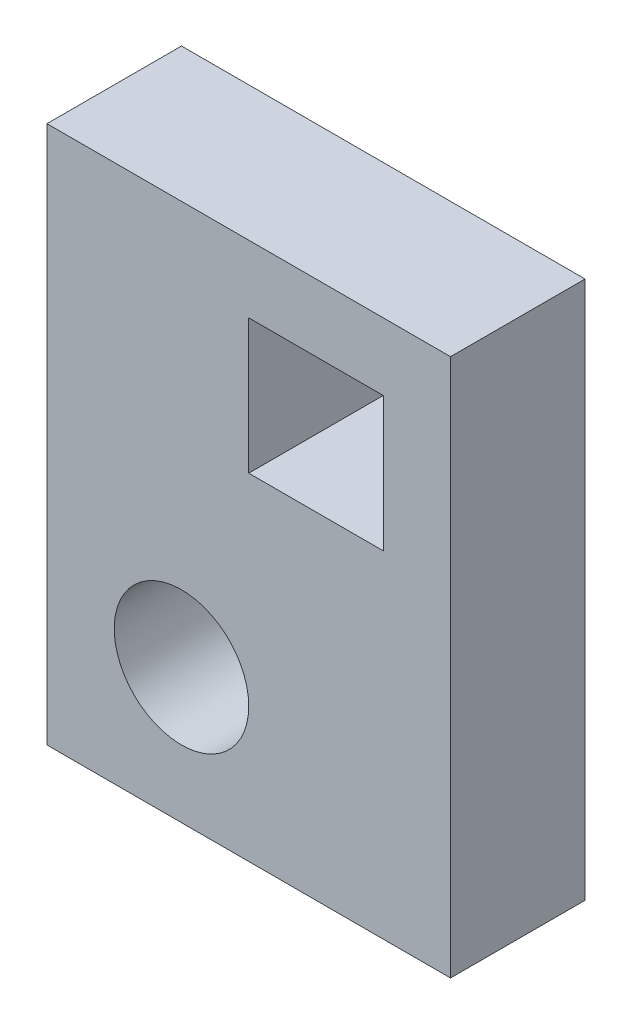
ISO-10303-21;
HEADER;
FILE_DESCRIPTION(('STEP AP214'),'2;1');
FILE_NAME('part.step','',(''),(''),'','','');
FILE_SCHEMA(('AUTOMOTIVE_DESIGN { 1 0 10303 214 1 1 1 1 }'));
ENDSEC;
DATA;
#1=APPLICATION_CONTEXT('core data for automotive mechanical design processes');
#2=APPLICATION_PROTOCOL_DEFINITION('international standard','automotive_design',2000,#1);
#3=PRODUCT_CONTEXT('',#1,'mechanical');
#4=PRODUCT('Part','Part','',(#3));
#5=PRODUCT_RELATED_PRODUCT_CATEGORY('part','',(#4));
#6=PRODUCT_DEFINITION_FORMATION('','',#4);
#7=PRODUCT_DEFINITION_CONTEXT('part definition',#1,'design');
#8=PRODUCT_DEFINITION('design','',#6,#7);
#9=PRODUCT_DEFINITION_SHAPE('','',#8);
#10=(LENGTH_UNIT() NAMED_UNIT(*) SI_UNIT(.MILLI.,.METRE.));
#11=(NAMED_UNIT(*) PLANE_ANGLE_UNIT() SI_UNIT($,.RADIAN.));
#12=(NAMED_UNIT(*) SI_UNIT($,.STERADIAN.) SOLID_ANGLE_UNIT());
#13=UNCERTAINTY_MEASURE_WITH_UNIT(LENGTH_MEASURE(1.E-05),#10,'distance_accuracy_value','');
#14=(GEOMETRIC_REPRESENTATION_CONTEXT(3) GLOBAL_UNCERTAINTY_ASSIGNED_CONTEXT((#13)) GLOBAL_UNIT_ASSIGNED_CONTEXT((#10,
#11,#12)) REPRESENTATION_CONTEXT('',''));
#15=CARTESIAN_POINT('',(0.,0.,0.));
#16=DIRECTION('',(0.,0.,1.));
#17=DIRECTION('',(1.,0.,0.));
#18=AXIS2_PLACEMENT_3D('',#15,#16,#17);
#19=CARTESIAN_POINT('',(0.,0.,25.4));
#20=DIRECTION('',(0.,0.,-1.));
#21=DIRECTION('',(-1.,0.,0.));
#22=AXIS2_PLACEMENT_3D('',#19,#20,#21);
#23=PLANE('',#22);
#24=CARTESIAN_POINT('',(25.4,25.4,25.4));
#25=DIRECTION('',(0.,0.,1.));
#26=DIRECTION('',(1.,0.,0.));
#27=AXIS2_PLACEMENT_3D('',#24,#25,#26);
#28=CIRCLE('',#27,12.7);
#29=CARTESIAN_POINT('',(38.1,25.4,25.4));
#30=VERTEX_POINT('',#29);
#31=EDGE_CURVE('E138',#30,#30,#28,.T.);
#32=ORIENTED_EDGE('',*,*,#31,.F.);
#33=EDGE_LOOP('',(#32));
#34=FACE_BOUND('',#33,.T.);
#35=DIRECTION('',(0.,-1.,0.));
#36=VECTOR('',#35,1.);
#37=CARTESIAN_POINT('',(0.,0.,25.4));
#38=LINE('',#37,#36);
#39=CARTESIAN_POINT('',(0.,101.6,25.4));
#40=VERTEX_POINT('',#39);
#41=CARTESIAN_POINT('',(0.,0.,25.4));
#42=VERTEX_POINT('',#41);
#43=EDGE_CURVE('E144',#40,#42,#38,.T.);
#44=ORIENTED_EDGE('',*,*,#43,.T.);
#45=DIRECTION('',(1.,0.,0.));
#46=VECTOR('',#45,1.);
#47=CARTESIAN_POINT('',(0.,0.,25.4));
#48=LINE('',#47,#46);
#49=CARTESIAN_POINT('',(76.2,0.,25.4));
#50=VERTEX_POINT('',#49);
#51=EDGE_CURVE('E147',#42,#50,#48,.T.);
#52=ORIENTED_EDGE('',*,*,#51,.T.);
#53=DIRECTION('',(0.,1.,0.));
#54=VECTOR('',#53,1.);
#55=CARTESIAN_POINT('',(76.2,0.,25.4));
#56=LINE('',#55,#54);
#57=CARTESIAN_POINT('',(76.2,101.6,25.4));
#58=VERTEX_POINT('',#57);
#59=EDGE_CURVE('E150',#50,#58,#56,.T.);
#60=ORIENTED_EDGE('',*,*,#59,.T.);
#61=DIRECTION('',(-1.,0.,0.));
#62=VECTOR('',#61,1.);
#63=CARTESIAN_POINT('',(0.,101.6,25.4));
#64=LINE('',#63,#62);
#65=EDGE_CURVE('E152',#58,#40,#64,.T.);
#66=ORIENTED_EDGE('',*,*,#65,.T.);
#67=EDGE_LOOP('',(#44,#52,#60,#66));
#68=FACE_BOUND('',#67,.T.);
#69=DIRECTION('',(0.,1.,0.));
#70=VECTOR('',#69,1.);
#71=CARTESIAN_POINT('',(63.5,88.9,25.4));
#72=LINE('',#71,#70);
#73=CARTESIAN_POINT('',(63.5,63.5,25.4));
#74=VERTEX_POINT('',#73);
#75=CARTESIAN_POINT('',(63.5,88.9,25.4));
#76=VERTEX_POINT('',#75);
#77=EDGE_CURVE('E102',#74,#76,#72,.T.);
#78=ORIENTED_EDGE('',*,*,#77,.F.);
#79=DIRECTION('',(1.,0.,0.));
#80=VECTOR('',#79,1.);
#81=CARTESIAN_POINT('',(38.1,63.5,25.4));
#82=LINE('',#81,#80);
#83=CARTESIAN_POINT('',(38.1,63.5,25.4));
#84=VERTEX_POINT('',#83);
#85=EDGE_CURVE('E124',#84,#74,#82,.T.);
#86=ORIENTED_EDGE('',*,*,#85,.F.);
#87=DIRECTION('',(0.,-1.,0.));
#88=VECTOR('',#87,1.);
#89=CARTESIAN_POINT('',(38.1,88.9,25.4));
#90=LINE('',#89,#88);
#91=CARTESIAN_POINT('',(38.1,88.9,25.4));
#92=VERTEX_POINT('',#91);
#93=EDGE_CURVE('E122',#92,#84,#90,.T.);
#94=ORIENTED_EDGE('',*,*,#93,.F.);
#95=DIRECTION('',(-1.,0.,0.));
#96=VECTOR('',#95,1.);
#97=CARTESIAN_POINT('',(38.1,88.9,25.4));
#98=LINE('',#97,#96);
#99=EDGE_CURVE('E110',#76,#92,#98,.T.);
#100=ORIENTED_EDGE('',*,*,#99,.F.);
#101=EDGE_LOOP('',(#78,#86,#94,#100));
#102=FACE_BOUND('',#101,.T.);
#103=ADVANCED_FACE('F37',(#34,#68,#102),#23,.F.);
#104=CARTESIAN_POINT('',(0.,0.,0.));
#105=DIRECTION('',(0.,0.,-1.));
#106=DIRECTION('',(-1.,0.,0.));
#107=AXIS2_PLACEMENT_3D('',#104,#105,#106);
#108=PLANE('',#107);
#109=DIRECTION('',(0.,-1.,0.));
#110=VECTOR('',#109,1.);
#111=CARTESIAN_POINT('',(0.,0.,0.));
#112=LINE('',#111,#110);
#113=CARTESIAN_POINT('',(0.,101.6,0.));
#114=VERTEX_POINT('',#113);
#115=CARTESIAN_POINT('',(0.,0.,0.));
#116=VERTEX_POINT('',#115);
#117=EDGE_CURVE('E141',#114,#116,#112,.T.);
#118=ORIENTED_EDGE('',*,*,#117,.F.);
#119=DIRECTION('',(-1.,0.,0.));
#120=VECTOR('',#119,1.);
#121=CARTESIAN_POINT('',(0.,101.6,0.));
#122=LINE('',#121,#120);
#123=CARTESIAN_POINT('',(76.2,101.6,0.));
#124=VERTEX_POINT('',#123);
#125=EDGE_CURVE('E148',#124,#114,#122,.T.);
#126=ORIENTED_EDGE('',*,*,#125,.F.);
#127=DIRECTION('',(0.,1.,0.));
#128=VECTOR('',#127,1.);
#129=CARTESIAN_POINT('',(76.2,0.,0.));
#130=LINE('',#129,#128);
#131=CARTESIAN_POINT('',(76.2,0.,0.));
#132=VERTEX_POINT('',#131);
#133=EDGE_CURVE('E159',#132,#124,#130,.T.);
#134=ORIENTED_EDGE('',*,*,#133,.F.);
#135=DIRECTION('',(1.,0.,0.));
#136=VECTOR('',#135,1.);
#137=CARTESIAN_POINT('',(0.,0.,0.));
#138=LINE('',#137,#136);
#139=EDGE_CURVE('E157',#116,#132,#138,.T.);
#140=ORIENTED_EDGE('',*,*,#139,.F.);
#141=EDGE_LOOP('',(#118,#126,#134,#140));
#142=FACE_BOUND('',#141,.T.);
#143=CARTESIAN_POINT('',(25.4,25.4,0.));
#144=DIRECTION('',(0.,0.,1.));
#145=DIRECTION('',(1.,0.,0.));
#146=AXIS2_PLACEMENT_3D('',#143,#144,#145);
#147=CIRCLE('',#146,12.7);
#148=CARTESIAN_POINT('',(38.1,25.4,0.));
#149=VERTEX_POINT('',#148);
#150=EDGE_CURVE('E118',#149,#149,#147,.T.);
#151=ORIENTED_EDGE('',*,*,#150,.T.);
#152=EDGE_LOOP('',(#151));
#153=FACE_BOUND('',#152,.T.);
#154=DIRECTION('',(1.,0.,0.));
#155=VECTOR('',#154,1.);
#156=CARTESIAN_POINT('',(38.1,63.5,0.));
#157=LINE('',#156,#155);
#158=CARTESIAN_POINT('',(38.1,63.5,0.));
#159=VERTEX_POINT('',#158);
#160=CARTESIAN_POINT('',(63.5,63.5,0.));
#161=VERTEX_POINT('',#160);
#162=EDGE_CURVE('E111',#159,#161,#157,.T.);
#163=ORIENTED_EDGE('',*,*,#162,.T.);
#164=DIRECTION('',(0.,1.,0.));
#165=VECTOR('',#164,1.);
#166=CARTESIAN_POINT('',(63.5,88.9,0.));
#167=LINE('',#166,#165);
#168=CARTESIAN_POINT('',(63.5,88.9,0.));
#169=VERTEX_POINT('',#168);
#170=EDGE_CURVE('E60',#161,#169,#167,.T.);
#171=ORIENTED_EDGE('',*,*,#170,.T.);
#172=DIRECTION('',(-1.,0.,0.));
#173=VECTOR('',#172,1.);
#174=CARTESIAN_POINT('',(38.1,88.9,0.));
#175=LINE('',#174,#173);
#176=CARTESIAN_POINT('',(38.1,88.9,0.));
#177=VERTEX_POINT('',#176);
#178=EDGE_CURVE('E117',#169,#177,#175,.T.);
#179=ORIENTED_EDGE('',*,*,#178,.T.);
#180=DIRECTION('',(0.,-1.,0.));
#181=VECTOR('',#180,1.);
#182=CARTESIAN_POINT('',(38.1,88.9,0.));
#183=LINE('',#182,#181);
#184=EDGE_CURVE('E130',#177,#159,#183,.T.);
#185=ORIENTED_EDGE('',*,*,#184,.T.);
#186=EDGE_LOOP('',(#163,#171,#179,#185));
#187=FACE_BOUND('',#186,.T.);
#188=ADVANCED_FACE('F177',(#142,#153,#187),#108,.T.);
#189=CARTESIAN_POINT('',(0.,0.,25.4));
#190=DIRECTION('',(1.,0.,0.));
#191=DIRECTION('',(0.,0.,-1.));
#192=AXIS2_PLACEMENT_3D('',#189,#190,#191);
#193=PLANE('',#192);
#194=ORIENTED_EDGE('',*,*,#117,.T.);
#195=DIRECTION('',(0.,0.,-1.));
#196=VECTOR('',#195,1.);
#197=CARTESIAN_POINT('',(0.,0.,25.4));
#198=LINE('',#197,#196);
#199=EDGE_CURVE('E11',#42,#116,#198,.T.);
#200=ORIENTED_EDGE('',*,*,#199,.F.);
#201=ORIENTED_EDGE('',*,*,#43,.F.);
#202=DIRECTION('',(0.,0.,-1.));
#203=VECTOR('',#202,1.);
#204=CARTESIAN_POINT('',(0.,101.6,25.4));
#205=LINE('',#204,#203);
#206=EDGE_CURVE('E154',#40,#114,#205,.T.);
#207=ORIENTED_EDGE('',*,*,#206,.T.);
#208=EDGE_LOOP('',(#194,#200,#201,#207));
#209=FACE_BOUND('',#208,.T.);
#210=ADVANCED_FACE('F39',(#209),#193,.F.);
#211=CARTESIAN_POINT('',(0.,0.,25.4));
#212=DIRECTION('',(0.,1.,0.));
#213=DIRECTION('',(0.,0.,1.));
#214=AXIS2_PLACEMENT_3D('',#211,#212,#213);
#215=PLANE('',#214);
#216=ORIENTED_EDGE('',*,*,#139,.T.);
#217=DIRECTION('',(0.,0.,-1.));
#218=VECTOR('',#217,1.);
#219=CARTESIAN_POINT('',(76.2,0.,25.4));
#220=LINE('',#219,#218);
#221=EDGE_CURVE('E45',#50,#132,#220,.T.);
#222=ORIENTED_EDGE('',*,*,#221,.F.);
#223=ORIENTED_EDGE('',*,*,#51,.F.);
#224=ORIENTED_EDGE('',*,*,#199,.T.);
#225=EDGE_LOOP('',(#216,#222,#223,#224));
#226=FACE_BOUND('',#225,.T.);
#227=ADVANCED_FACE('F187',(#226),#215,.F.);
#228=CARTESIAN_POINT('',(76.2,0.,25.4));
#229=DIRECTION('',(-1.,0.,0.));
#230=DIRECTION('',(0.,0.,1.));
#231=AXIS2_PLACEMENT_3D('',#228,#229,#230);
#232=PLANE('',#231);
#233=ORIENTED_EDGE('',*,*,#133,.T.);
#234=DIRECTION('',(0.,0.,-1.));
#235=VECTOR('',#234,1.);
#236=CARTESIAN_POINT('',(76.2,101.6,25.4));
#237=LINE('',#236,#235);
#238=EDGE_CURVE('E164',#58,#124,#237,.T.);
#239=ORIENTED_EDGE('',*,*,#238,.F.);
#240=ORIENTED_EDGE('',*,*,#59,.F.);
#241=ORIENTED_EDGE('',*,*,#221,.T.);
#242=EDGE_LOOP('',(#233,#239,#240,#241));
#243=FACE_BOUND('',#242,.T.);
#244=ADVANCED_FACE('F171',(#243),#232,.F.);
#245=CARTESIAN_POINT('',(0.,101.6,25.4));
#246=DIRECTION('',(0.,-1.,0.));
#247=DIRECTION('',(0.,0.,-1.));
#248=AXIS2_PLACEMENT_3D('',#245,#246,#247);
#249=PLANE('',#248);
#250=ORIENTED_EDGE('',*,*,#125,.T.);
#251=ORIENTED_EDGE('',*,*,#206,.F.);
#252=ORIENTED_EDGE('',*,*,#65,.F.);
#253=ORIENTED_EDGE('',*,*,#238,.T.);
#254=EDGE_LOOP('',(#250,#251,#252,#253));
#255=FACE_BOUND('',#254,.T.);
#256=ADVANCED_FACE('F181',(#255),#249,.F.);
#257=CARTESIAN_POINT('',(25.4,25.4,25.4));
#258=DIRECTION('',(0.,0.,-1.));
#259=DIRECTION('',(-1.,0.,0.));
#260=AXIS2_PLACEMENT_3D('',#257,#258,#259);
#261=CYLINDRICAL_SURFACE('',#260,12.7);
#262=ORIENTED_EDGE('',*,*,#31,.T.);
#263=EDGE_LOOP('',(#262));
#264=FACE_BOUND('',#263,.T.);
#265=ORIENTED_EDGE('',*,*,#150,.F.);
#266=EDGE_LOOP('',(#265));
#267=FACE_BOUND('',#266,.T.);
#268=ADVANCED_FACE('F203',(#264,#267),#261,.F.);
#269=CARTESIAN_POINT('',(63.5,88.9,25.4));
#270=DIRECTION('',(-1.,0.,0.));
#271=DIRECTION('',(0.,0.,1.));
#272=AXIS2_PLACEMENT_3D('',#269,#270,#271);
#273=PLANE('',#272);
#274=ORIENTED_EDGE('',*,*,#170,.F.);
#275=DIRECTION('',(0.,0.,-1.));
#276=VECTOR('',#275,1.);
#277=CARTESIAN_POINT('',(63.5,63.5,25.4));
#278=LINE('',#277,#276);
#279=EDGE_CURVE('E106',#74,#161,#278,.T.);
#280=ORIENTED_EDGE('',*,*,#279,.F.);
#281=ORIENTED_EDGE('',*,*,#77,.T.);
#282=DIRECTION('',(0.,0.,-1.));
#283=VECTOR('',#282,1.);
#284=CARTESIAN_POINT('',(63.5,88.9,25.4));
#285=LINE('',#284,#283);
#286=EDGE_CURVE('E105',#76,#169,#285,.T.);
#287=ORIENTED_EDGE('',*,*,#286,.T.);
#288=EDGE_LOOP('',(#274,#280,#281,#287));
#289=FACE_BOUND('',#288,.T.);
#290=ADVANCED_FACE('F104',(#289),#273,.T.);
#291=CARTESIAN_POINT('',(38.1,88.9,25.4));
#292=DIRECTION('',(0.,-1.,0.));
#293=DIRECTION('',(0.,0.,-1.));
#294=AXIS2_PLACEMENT_3D('',#291,#292,#293);
#295=PLANE('',#294);
#296=ORIENTED_EDGE('',*,*,#178,.F.);
#297=ORIENTED_EDGE('',*,*,#286,.F.);
#298=ORIENTED_EDGE('',*,*,#99,.T.);
#299=DIRECTION('',(0.,0.,-1.));
#300=VECTOR('',#299,1.);
#301=CARTESIAN_POINT('',(38.1,88.9,25.4));
#302=LINE('',#301,#300);
#303=EDGE_CURVE('E119',#92,#177,#302,.T.);
#304=ORIENTED_EDGE('',*,*,#303,.T.);
#305=EDGE_LOOP('',(#296,#297,#298,#304));
#306=FACE_BOUND('',#305,.T.);
#307=ADVANCED_FACE('F114',(#306),#295,.T.);
#308=CARTESIAN_POINT('',(38.1,88.9,25.4));
#309=DIRECTION('',(1.,0.,0.));
#310=DIRECTION('',(0.,0.,-1.));
#311=AXIS2_PLACEMENT_3D('',#308,#309,#310);
#312=PLANE('',#311);
#313=ORIENTED_EDGE('',*,*,#184,.F.);
#314=ORIENTED_EDGE('',*,*,#303,.F.);
#315=ORIENTED_EDGE('',*,*,#93,.T.);
#316=DIRECTION('',(0.,0.,-1.));
#317=VECTOR('',#316,1.);
#318=CARTESIAN_POINT('',(38.1,63.5,25.4));
#319=LINE('',#318,#317);
#320=EDGE_CURVE('E52',#84,#159,#319,.T.);
#321=ORIENTED_EDGE('',*,*,#320,.T.);
#322=EDGE_LOOP('',(#313,#314,#315,#321));
#323=FACE_BOUND('',#322,.T.);
#324=ADVANCED_FACE('F220',(#323),#312,.T.);
#325=CARTESIAN_POINT('',(38.1,63.5,25.4));
#326=DIRECTION('',(0.,1.,0.));
#327=DIRECTION('',(0.,0.,1.));
#328=AXIS2_PLACEMENT_3D('',#325,#326,#327);
#329=PLANE('',#328);
#330=ORIENTED_EDGE('',*,*,#162,.F.);
#331=ORIENTED_EDGE('',*,*,#320,.F.);
#332=ORIENTED_EDGE('',*,*,#85,.T.);
#333=ORIENTED_EDGE('',*,*,#279,.T.);
#334=EDGE_LOOP('',(#330,#331,#332,#333));
#335=FACE_BOUND('',#334,.T.);
#336=ADVANCED_FACE('F218',(#335),#329,.T.);
#337=CLOSED_SHELL('',(#103,#188,#210,#227,#244,#256,#268,#290,#307,#324,#336));
#338=MANIFOLD_SOLID_BREP('B2',#337);
#339=ADVANCED_BREP_SHAPE_REPRESENTATION('',(#18,#338),#14);
#340=SHAPE_DEFINITION_REPRESENTATION(#9,#339);
ENDSEC;
END-ISO-10303-21;
